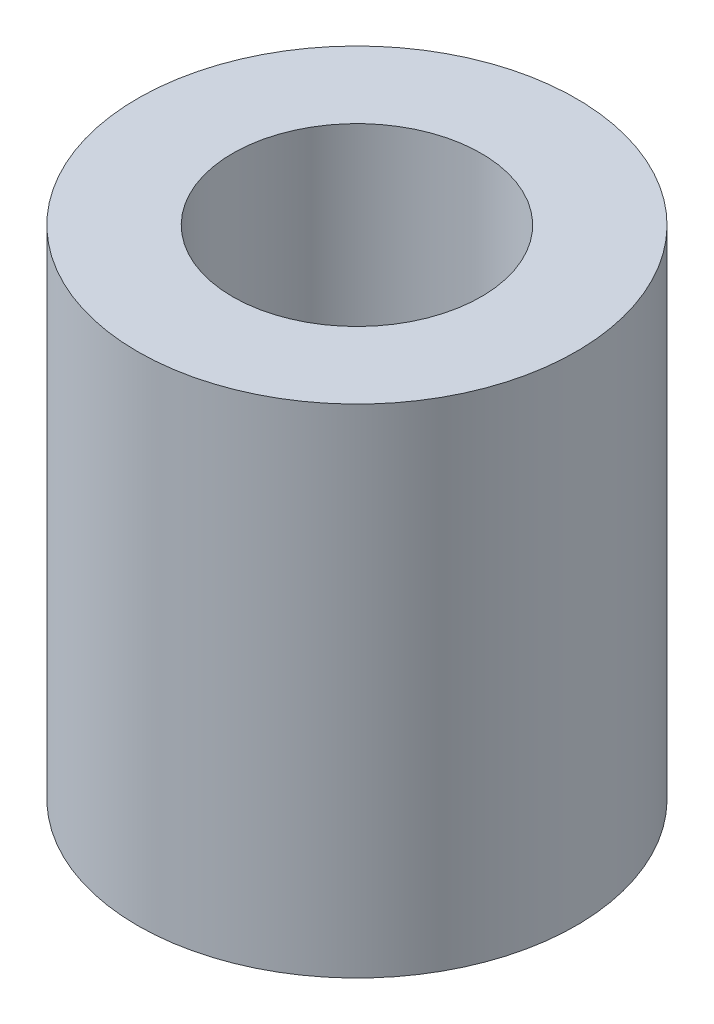
ISO-10303-21;
HEADER;
FILE_DESCRIPTION(('STEP AP214'),'2;1');
FILE_NAME('part.step','',(''),(''),'','','');
FILE_SCHEMA(('AUTOMOTIVE_DESIGN { 1 0 10303 214 1 1 1 1 }'));
ENDSEC;
DATA;
#1=APPLICATION_CONTEXT('core data for automotive mechanical design processes');
#2=APPLICATION_PROTOCOL_DEFINITION('international standard','automotive_design',2000,#1);
#3=PRODUCT_CONTEXT('',#1,'mechanical');
#4=PRODUCT('Part','Part','',(#3));
#5=PRODUCT_RELATED_PRODUCT_CATEGORY('part','',(#4));
#6=PRODUCT_DEFINITION_FORMATION('','',#4);
#7=PRODUCT_DEFINITION_CONTEXT('part definition',#1,'design');
#8=PRODUCT_DEFINITION('design','',#6,#7);
#9=PRODUCT_DEFINITION_SHAPE('','',#8);
#10=(LENGTH_UNIT() NAMED_UNIT(*) SI_UNIT(.MILLI.,.METRE.));
#11=(NAMED_UNIT(*) PLANE_ANGLE_UNIT() SI_UNIT($,.RADIAN.));
#12=(NAMED_UNIT(*) SI_UNIT($,.STERADIAN.) SOLID_ANGLE_UNIT());
#13=UNCERTAINTY_MEASURE_WITH_UNIT(LENGTH_MEASURE(1.E-05),#10,'distance_accuracy_value','');
#14=(GEOMETRIC_REPRESENTATION_CONTEXT(3) GLOBAL_UNCERTAINTY_ASSIGNED_CONTEXT((#13)) GLOBAL_UNIT_ASSIGNED_CONTEXT((#10,
#11,#12)) REPRESENTATION_CONTEXT('',''));
#15=CARTESIAN_POINT('',(0.,0.,0.));
#16=DIRECTION('',(0.,0.,1.));
#17=DIRECTION('',(1.,0.,0.));
#18=AXIS2_PLACEMENT_3D('',#15,#16,#17);
#19=CARTESIAN_POINT('',(0.,17.,0.));
#20=DIRECTION('',(0.,1.,0.));
#21=DIRECTION('',(0.,0.,1.));
#22=AXIS2_PLACEMENT_3D('',#19,#20,#21);
#23=PLANE('',#22);
#24=CARTESIAN_POINT('',(0.,17.,0.));
#25=DIRECTION('',(0.,1.,0.));
#26=DIRECTION('',(0.,0.,1.));
#27=AXIS2_PLACEMENT_3D('',#24,#25,#26);
#28=CIRCLE('',#27,7.5);
#29=CARTESIAN_POINT('',(0.,17.,7.5));
#30=VERTEX_POINT('',#29);
#31=EDGE_CURVE('E10',#30,#30,#28,.T.);
#32=ORIENTED_EDGE('',*,*,#31,.T.);
#33=EDGE_LOOP('',(#32));
#34=FACE_BOUND('',#33,.T.);
#35=CARTESIAN_POINT('',(0.,17.,0.));
#36=DIRECTION('',(0.,1.,0.));
#37=DIRECTION('',(0.,0.,1.));
#38=AXIS2_PLACEMENT_3D('',#35,#36,#37);
#39=CIRCLE('',#38,4.25);
#40=CARTESIAN_POINT('',(0.,17.,4.25));
#41=VERTEX_POINT('',#40);
#42=EDGE_CURVE('E50',#41,#41,#39,.T.);
#43=ORIENTED_EDGE('',*,*,#42,.F.);
#44=EDGE_LOOP('',(#43));
#45=FACE_BOUND('',#44,.T.);
#46=ADVANCED_FACE('F37',(#34,#45),#23,.T.);
#47=CARTESIAN_POINT('',(0.,0.,0.));
#48=DIRECTION('',(0.,1.,0.));
#49=DIRECTION('',(0.,0.,1.));
#50=AXIS2_PLACEMENT_3D('',#47,#48,#49);
#51=PLANE('',#50);
#52=CARTESIAN_POINT('',(0.,0.,0.));
#53=DIRECTION('',(0.,1.,0.));
#54=DIRECTION('',(0.,0.,1.));
#55=AXIS2_PLACEMENT_3D('',#52,#53,#54);
#56=CIRCLE('',#55,7.5);
#57=CARTESIAN_POINT('',(0.,0.,7.5));
#58=VERTEX_POINT('',#57);
#59=EDGE_CURVE('E41',#58,#58,#56,.T.);
#60=ORIENTED_EDGE('',*,*,#59,.F.);
#61=EDGE_LOOP('',(#60));
#62=FACE_BOUND('',#61,.T.);
#63=CARTESIAN_POINT('',(0.,0.,0.));
#64=DIRECTION('',(0.,1.,0.));
#65=DIRECTION('',(0.,0.,1.));
#66=AXIS2_PLACEMENT_3D('',#63,#64,#65);
#67=CIRCLE('',#66,4.25);
#68=CARTESIAN_POINT('',(0.,0.,4.25));
#69=VERTEX_POINT('',#68);
#70=EDGE_CURVE('E52',#69,#69,#67,.T.);
#71=ORIENTED_EDGE('',*,*,#70,.T.);
#72=EDGE_LOOP('',(#71));
#73=FACE_BOUND('',#72,.T.);
#74=ADVANCED_FACE('F64',(#62,#73),#51,.F.);
#75=CARTESIAN_POINT('',(0.,17.,0.));
#76=DIRECTION('',(0.,-1.,0.));
#77=DIRECTION('',(0.,0.,-1.));
#78=AXIS2_PLACEMENT_3D('',#75,#76,#77);
#79=CYLINDRICAL_SURFACE('',#78,7.5);
#80=ORIENTED_EDGE('',*,*,#31,.F.);
#81=EDGE_LOOP('',(#80));
#82=FACE_BOUND('',#81,.T.);
#83=ORIENTED_EDGE('',*,*,#59,.T.);
#84=EDGE_LOOP('',(#83));
#85=FACE_BOUND('',#84,.T.);
#86=ADVANCED_FACE('F39',(#82,#85),#79,.T.);
#87=CARTESIAN_POINT('',(0.,17.,0.));
#88=DIRECTION('',(0.,-1.,0.));
#89=DIRECTION('',(0.,0.,-1.));
#90=AXIS2_PLACEMENT_3D('',#87,#88,#89);
#91=CYLINDRICAL_SURFACE('',#90,4.25);
#92=ORIENTED_EDGE('',*,*,#42,.T.);
#93=EDGE_LOOP('',(#92));
#94=FACE_BOUND('',#93,.T.);
#95=ORIENTED_EDGE('',*,*,#70,.F.);
#96=EDGE_LOOP('',(#95));
#97=FACE_BOUND('',#96,.T.);
#98=ADVANCED_FACE('F60',(#94,#97),#91,.F.);
#99=CLOSED_SHELL('',(#46,#74,#86,#98));
#100=MANIFOLD_SOLID_BREP('B2',#99);
#101=ADVANCED_BREP_SHAPE_REPRESENTATION('',(#18,#100),#14);
#102=SHAPE_DEFINITION_REPRESENTATION(#9,#101);
ENDSEC;
END-ISO-10303-21;
